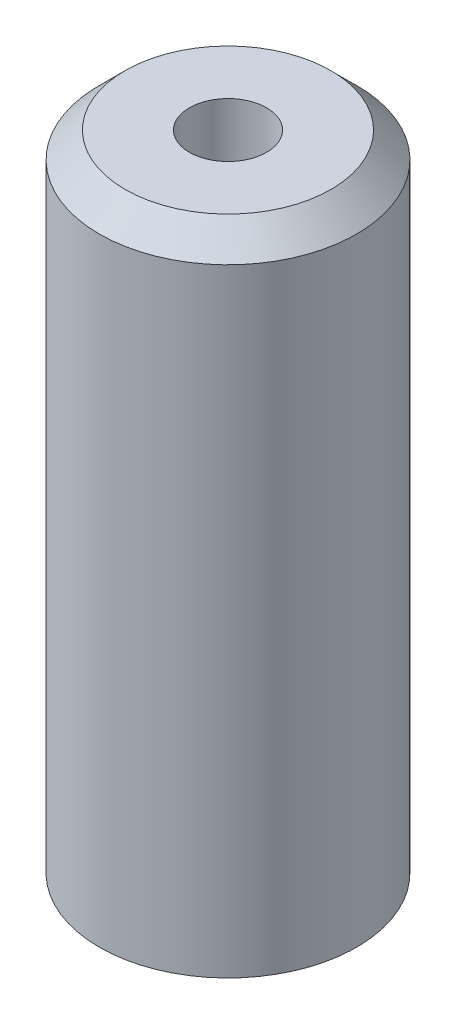
ISO-10303-21;
HEADER;
FILE_DESCRIPTION(('STEP AP214'),'2;1');
FILE_NAME('part.step','',(''),(''),'','','');
FILE_SCHEMA(('AUTOMOTIVE_DESIGN { 1 0 10303 214 1 1 1 1 }'));
ENDSEC;
DATA;
#1=APPLICATION_CONTEXT('core data for automotive mechanical design processes');
#2=APPLICATION_PROTOCOL_DEFINITION('international standard','automotive_design',2000,#1);
#3=PRODUCT_CONTEXT('',#1,'mechanical');
#4=PRODUCT('Part','Part','',(#3));
#5=PRODUCT_RELATED_PRODUCT_CATEGORY('part','',(#4));
#6=PRODUCT_DEFINITION_FORMATION('','',#4);
#7=PRODUCT_DEFINITION_CONTEXT('part definition',#1,'design');
#8=PRODUCT_DEFINITION('design','',#6,#7);
#9=PRODUCT_DEFINITION_SHAPE('','',#8);
#10=(LENGTH_UNIT() NAMED_UNIT(*) SI_UNIT(.MILLI.,.METRE.));
#11=(NAMED_UNIT(*) PLANE_ANGLE_UNIT() SI_UNIT($,.RADIAN.));
#12=(NAMED_UNIT(*) SI_UNIT($,.STERADIAN.) SOLID_ANGLE_UNIT());
#13=UNCERTAINTY_MEASURE_WITH_UNIT(LENGTH_MEASURE(1.E-05),#10,'distance_accuracy_value','');
#14=(GEOMETRIC_REPRESENTATION_CONTEXT(3) GLOBAL_UNCERTAINTY_ASSIGNED_CONTEXT((#13)) GLOBAL_UNIT_ASSIGNED_CONTEXT((#10,
#11,#12)) REPRESENTATION_CONTEXT('',''));
#15=CARTESIAN_POINT('',(0.,0.,0.));
#16=DIRECTION('',(0.,0.,1.));
#17=DIRECTION('',(1.,0.,0.));
#18=AXIS2_PLACEMENT_3D('',#15,#16,#17);
#19=CARTESIAN_POINT('',(0.,0.,0.));
#20=DIRECTION('',(0.,1.,0.));
#21=DIRECTION('',(0.,0.,1.));
#22=AXIS2_PLACEMENT_3D('',#19,#20,#21);
#23=PLANE('',#22);
#24=CARTESIAN_POINT('',(0.,0.,0.));
#25=DIRECTION('',(0.,1.,0.));
#26=DIRECTION('',(0.,0.,1.));
#27=AXIS2_PLACEMENT_3D('',#24,#25,#26);
#28=CIRCLE('',#27,1.5);
#29=CARTESIAN_POINT('',(0.,0.,1.5));
#30=VERTEX_POINT('',#29);
#31=EDGE_CURVE('E56',#30,#30,#28,.T.);
#32=ORIENTED_EDGE('',*,*,#31,.F.);
#33=EDGE_LOOP('',(#32));
#34=FACE_BOUND('',#33,.T.);
#35=CARTESIAN_POINT('',(0.,0.,0.));
#36=DIRECTION('',(0.,1.,0.));
#37=DIRECTION('',(0.,0.,1.));
#38=AXIS2_PLACEMENT_3D('',#35,#36,#37);
#39=CIRCLE('',#38,4.);
#40=CARTESIAN_POINT('',(0.,0.,4.));
#41=VERTEX_POINT('',#40);
#42=EDGE_CURVE('E10',#41,#41,#39,.T.);
#43=ORIENTED_EDGE('',*,*,#42,.T.);
#44=EDGE_LOOP('',(#43));
#45=FACE_BOUND('',#44,.T.);
#46=ADVANCED_FACE('F34',(#34,#45),#23,.T.);
#47=CARTESIAN_POINT('',(0.,0.,0.));
#48=DIRECTION('',(0.,-1.,0.));
#49=DIRECTION('',(0.,0.,-1.));
#50=AXIS2_PLACEMENT_3D('',#47,#48,#49);
#51=CONICAL_SURFACE('',#50,4.,0.785398163397442);
#52=CARTESIAN_POINT('',(0.,-1.00000000000001,0.));
#53=DIRECTION('',(0.,1.,0.));
#54=DIRECTION('',(0.,0.,1.));
#55=AXIS2_PLACEMENT_3D('',#52,#53,#54);
#56=CIRCLE('',#55,5.);
#57=CARTESIAN_POINT('',(0.,-1.00000000000001,5.));
#58=VERTEX_POINT('',#57);
#59=EDGE_CURVE('E41',#58,#58,#56,.T.);
#60=ORIENTED_EDGE('',*,*,#59,.T.);
#61=EDGE_LOOP('',(#60));
#62=FACE_BOUND('',#61,.T.);
#63=ORIENTED_EDGE('',*,*,#42,.F.);
#64=EDGE_LOOP('',(#63));
#65=FACE_BOUND('',#64,.T.);
#66=ADVANCED_FACE('F76',(#62,#65),#51,.T.);
#67=CARTESIAN_POINT('',(0.,3.58445839320066,0.));
#68=DIRECTION('',(0.,1.,0.));
#69=DIRECTION('',(0.,0.,1.));
#70=AXIS2_PLACEMENT_3D('',#67,#68,#69);
#71=CYLINDRICAL_SURFACE('',#70,5.);
#72=CARTESIAN_POINT('',(0.,-25.,0.));
#73=DIRECTION('',(0.,1.,0.));
#74=DIRECTION('',(0.,0.,1.));
#75=AXIS2_PLACEMENT_3D('',#72,#73,#74);
#76=CIRCLE('',#75,5.);
#77=CARTESIAN_POINT('',(0.,-25.,5.));
#78=VERTEX_POINT('',#77);
#79=EDGE_CURVE('E45',#78,#78,#76,.T.);
#80=ORIENTED_EDGE('',*,*,#79,.T.);
#81=EDGE_LOOP('',(#80));
#82=FACE_BOUND('',#81,.T.);
#83=ORIENTED_EDGE('',*,*,#59,.F.);
#84=EDGE_LOOP('',(#83));
#85=FACE_BOUND('',#84,.T.);
#86=ADVANCED_FACE('F81',(#82,#85),#71,.T.);
#87=CARTESIAN_POINT('',(5.,-25.,0.));
#88=DIRECTION('',(0.,-1.,0.));
#89=DIRECTION('',(0.,0.,-1.));
#90=AXIS2_PLACEMENT_3D('',#87,#88,#89);
#91=PLANE('',#90);
#92=CARTESIAN_POINT('',(0.,-25.,0.));
#93=DIRECTION('',(0.,-1.,0.));
#94=DIRECTION('',(0.,0.,-1.));
#95=AXIS2_PLACEMENT_3D('',#92,#93,#94);
#96=CIRCLE('',#95,2.99999999999999);
#97=CARTESIAN_POINT('',(0.,-25.,-2.99999999999999));
#98=VERTEX_POINT('',#97);
#99=EDGE_CURVE('E53',#98,#98,#96,.T.);
#100=ORIENTED_EDGE('',*,*,#99,.F.);
#101=EDGE_LOOP('',(#100));
#102=FACE_BOUND('',#101,.T.);
#103=ORIENTED_EDGE('',*,*,#79,.F.);
#104=EDGE_LOOP('',(#103));
#105=FACE_BOUND('',#104,.T.);
#106=ADVANCED_FACE('F86',(#102,#105),#91,.T.);
#107=CARTESIAN_POINT('',(0.,-5.,0.));
#108=DIRECTION('',(0.,-1.,0.));
#109=DIRECTION('',(0.,0.,-1.));
#110=AXIS2_PLACEMENT_3D('',#107,#108,#109);
#111=CONICAL_SURFACE('',#110,2.99999999999999,1.02974425867665);
#112=CARTESIAN_POINT('',(0.,-4.09870907145866,0.));
#113=DIRECTION('',(0.,-1.,0.));
#114=DIRECTION('',(0.,0.,-1.));
#115=AXIS2_PLACEMENT_3D('',#112,#113,#114);
#116=CIRCLE('',#115,1.5);
#117=CARTESIAN_POINT('',(0.,-4.09870907145866,-1.5));
#118=VERTEX_POINT('',#117);
#119=EDGE_CURVE('E37',#118,#118,#116,.F.);
#120=ORIENTED_EDGE('',*,*,#119,.T.);
#121=EDGE_LOOP('',(#120));
#122=FACE_BOUND('',#121,.T.);
#123=CARTESIAN_POINT('',(0.,-5.,0.));
#124=DIRECTION('',(0.,-1.,0.));
#125=DIRECTION('',(0.,0.,-1.));
#126=AXIS2_PLACEMENT_3D('',#123,#124,#125);
#127=CIRCLE('',#126,2.99999999999999);
#128=CARTESIAN_POINT('',(0.,-5.,-2.99999999999999));
#129=VERTEX_POINT('',#128);
#130=EDGE_CURVE('E50',#129,#129,#127,.T.);
#131=ORIENTED_EDGE('',*,*,#130,.T.);
#132=EDGE_LOOP('',(#131));
#133=FACE_BOUND('',#132,.T.);
#134=ADVANCED_FACE('F63',(#122,#133),#111,.F.);
#135=CARTESIAN_POINT('',(0.,-25.,0.));
#136=DIRECTION('',(0.,-1.,0.));
#137=DIRECTION('',(0.,0.,-1.));
#138=AXIS2_PLACEMENT_3D('',#135,#136,#137);
#139=CYLINDRICAL_SURFACE('',#138,2.99999999999999);
#140=ORIENTED_EDGE('',*,*,#130,.F.);
#141=EDGE_LOOP('',(#140));
#142=FACE_BOUND('',#141,.T.);
#143=ORIENTED_EDGE('',*,*,#99,.T.);
#144=EDGE_LOOP('',(#143));
#145=FACE_BOUND('',#144,.T.);
#146=ADVANCED_FACE('F68',(#142,#145),#139,.F.);
#147=CARTESIAN_POINT('',(0.,-25.,0.));
#148=DIRECTION('',(0.,1.,0.));
#149=DIRECTION('',(0.,0.,1.));
#150=AXIS2_PLACEMENT_3D('',#147,#148,#149);
#151=CYLINDRICAL_SURFACE('',#150,1.5);
#152=ORIENTED_EDGE('',*,*,#31,.T.);
#153=EDGE_LOOP('',(#152));
#154=FACE_BOUND('',#153,.T.);
#155=ORIENTED_EDGE('',*,*,#119,.F.);
#156=EDGE_LOOP('',(#155));
#157=FACE_BOUND('',#156,.T.);
#158=ADVANCED_FACE('F66',(#154,#157),#151,.F.);
#159=CLOSED_SHELL('',(#46,#66,#86,#106,#134,#146,#158));
#160=MANIFOLD_SOLID_BREP('B2',#159);
#161=ADVANCED_BREP_SHAPE_REPRESENTATION('',(#18,#160),#14);
#162=SHAPE_DEFINITION_REPRESENTATION(#9,#161);
ENDSEC;
END-ISO-10303-21;
